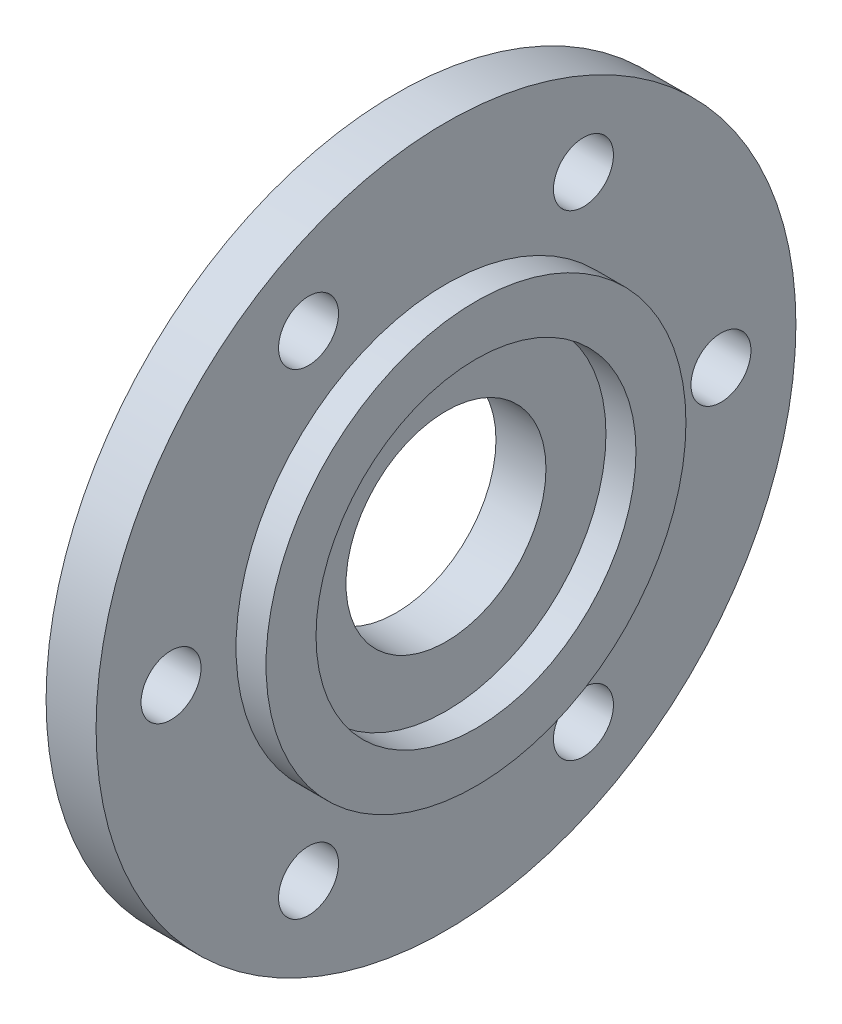
ISO-10303-21;
HEADER;
FILE_DESCRIPTION(('STEP AP214'),'2;1');
FILE_NAME('part.step','',(''),(''),'','','');
FILE_SCHEMA(('AUTOMOTIVE_DESIGN { 1 0 10303 214 1 1 1 1 }'));
ENDSEC;
DATA;
#1=APPLICATION_CONTEXT('core data for automotive mechanical design processes');
#2=APPLICATION_PROTOCOL_DEFINITION('international standard','automotive_design',2000,#1);
#3=PRODUCT_CONTEXT('',#1,'mechanical');
#4=PRODUCT('Part','Part','',(#3));
#5=PRODUCT_RELATED_PRODUCT_CATEGORY('part','',(#4));
#6=PRODUCT_DEFINITION_FORMATION('','',#4);
#7=PRODUCT_DEFINITION_CONTEXT('part definition',#1,'design');
#8=PRODUCT_DEFINITION('design','',#6,#7);
#9=PRODUCT_DEFINITION_SHAPE('','',#8);
#10=(LENGTH_UNIT() NAMED_UNIT(*) SI_UNIT(.MILLI.,.METRE.));
#11=(NAMED_UNIT(*) PLANE_ANGLE_UNIT() SI_UNIT($,.RADIAN.));
#12=(NAMED_UNIT(*) SI_UNIT($,.STERADIAN.) SOLID_ANGLE_UNIT());
#13=UNCERTAINTY_MEASURE_WITH_UNIT(LENGTH_MEASURE(1.E-05),#10,'distance_accuracy_value','');
#14=(GEOMETRIC_REPRESENTATION_CONTEXT(3) GLOBAL_UNCERTAINTY_ASSIGNED_CONTEXT((#13)) GLOBAL_UNIT_ASSIGNED_CONTEXT((#10,
#11,#12)) REPRESENTATION_CONTEXT('',''));
#15=CARTESIAN_POINT('',(0.,0.,0.));
#16=DIRECTION('',(0.,0.,1.));
#17=DIRECTION('',(1.,0.,0.));
#18=AXIS2_PLACEMENT_3D('',#15,#16,#17);
#19=CARTESIAN_POINT('',(0.,0.,0.));
#20=DIRECTION('',(-1.,0.,0.));
#21=DIRECTION('',(0.,0.,1.));
#22=AXIS2_PLACEMENT_3D('',#19,#20,#21);
#23=PLANE('',#22);
#24=CARTESIAN_POINT('',(0.,0.,0.));
#25=DIRECTION('',(-1.,0.,0.));
#26=DIRECTION('',(0.,0.,1.));
#27=AXIS2_PLACEMENT_3D('',#24,#25,#26);
#28=CIRCLE('',#27,10.);
#29=CARTESIAN_POINT('',(0.,0.,10.));
#30=VERTEX_POINT('',#29);
#31=EDGE_CURVE('E39',#30,#30,#28,.T.);
#32=ORIENTED_EDGE('',*,*,#31,.F.);
#33=EDGE_LOOP('',(#32));
#34=FACE_BOUND('',#33,.T.);
#35=CARTESIAN_POINT('',(0.,-23.8156986040719,-13.7500000000003));
#36=DIRECTION('',(-1.,0.,0.));
#37=DIRECTION('',(0.,0.,1.));
#38=AXIS2_PLACEMENT_3D('',#35,#36,#37);
#39=CIRCLE('',#38,3.);
#40=CARTESIAN_POINT('',(0.,-23.8156986040719,-10.7500000000003));
#41=VERTEX_POINT('',#40);
#42=EDGE_CURVE('E75',#41,#41,#39,.T.);
#43=ORIENTED_EDGE('',*,*,#42,.F.);
#44=EDGE_LOOP('',(#43));
#45=FACE_BOUND('',#44,.T.);
#46=CARTESIAN_POINT('',(0.,-23.8156986040722,13.7499999999998));
#47=DIRECTION('',(-1.,0.,0.));
#48=DIRECTION('',(0.,0.,1.));
#49=AXIS2_PLACEMENT_3D('',#46,#47,#48);
#50=CIRCLE('',#49,3.);
#51=CARTESIAN_POINT('',(0.,-23.8156986040722,16.7499999999998));
#52=VERTEX_POINT('',#51);
#53=EDGE_CURVE('E79',#52,#52,#50,.T.);
#54=ORIENTED_EDGE('',*,*,#53,.F.);
#55=EDGE_LOOP('',(#54));
#56=FACE_BOUND('',#55,.T.);
#57=CARTESIAN_POINT('',(0.,0.,27.5));
#58=DIRECTION('',(-1.,0.,0.));
#59=DIRECTION('',(0.,0.,1.));
#60=AXIS2_PLACEMENT_3D('',#57,#58,#59);
#61=CIRCLE('',#60,3.);
#62=CARTESIAN_POINT('',(0.,0.,30.5));
#63=VERTEX_POINT('',#62);
#64=EDGE_CURVE('E83',#63,#63,#61,.T.);
#65=ORIENTED_EDGE('',*,*,#64,.F.);
#66=EDGE_LOOP('',(#65));
#67=FACE_BOUND('',#66,.T.);
#68=CARTESIAN_POINT('',(0.,23.815698604072,13.7500000000001));
#69=DIRECTION('',(-1.,0.,0.));
#70=DIRECTION('',(0.,0.,1.));
#71=AXIS2_PLACEMENT_3D('',#68,#69,#70);
#72=CIRCLE('',#71,3.);
#73=CARTESIAN_POINT('',(0.,23.815698604072,16.7500000000001));
#74=VERTEX_POINT('',#73);
#75=EDGE_CURVE('E87',#74,#74,#72,.T.);
#76=ORIENTED_EDGE('',*,*,#75,.F.);
#77=EDGE_LOOP('',(#76));
#78=FACE_BOUND('',#77,.T.);
#79=CARTESIAN_POINT('',(0.,23.8156986040721,-13.7499999999999));
#80=DIRECTION('',(-1.,0.,0.));
#81=DIRECTION('',(0.,0.,1.));
#82=AXIS2_PLACEMENT_3D('',#79,#80,#81);
#83=CIRCLE('',#82,3.);
#84=CARTESIAN_POINT('',(0.,23.8156986040721,-10.7499999999999));
#85=VERTEX_POINT('',#84);
#86=EDGE_CURVE('E91',#85,#85,#83,.T.);
#87=ORIENTED_EDGE('',*,*,#86,.F.);
#88=EDGE_LOOP('',(#87));
#89=FACE_BOUND('',#88,.T.);
#90=CARTESIAN_POINT('',(0.,0.,-27.5));
#91=DIRECTION('',(-1.,0.,0.));
#92=DIRECTION('',(0.,0.,1.));
#93=AXIS2_PLACEMENT_3D('',#90,#91,#92);
#94=CIRCLE('',#93,3.);
#95=CARTESIAN_POINT('',(0.,0.,-24.5));
#96=VERTEX_POINT('',#95);
#97=EDGE_CURVE('E67',#96,#96,#94,.T.);
#98=ORIENTED_EDGE('',*,*,#97,.F.);
#99=EDGE_LOOP('',(#98));
#100=FACE_BOUND('',#99,.T.);
#101=CARTESIAN_POINT('',(0.,0.,0.));
#102=DIRECTION('',(1.,0.,0.));
#103=DIRECTION('',(0.,0.,-1.));
#104=AXIS2_PLACEMENT_3D('',#101,#102,#103);
#105=CIRCLE('',#104,35.);
#106=CARTESIAN_POINT('',(0.,0.,-35.));
#107=VERTEX_POINT('',#106);
#108=EDGE_CURVE('E10',#107,#107,#105,.T.);
#109=ORIENTED_EDGE('',*,*,#108,.F.);
#110=EDGE_LOOP('',(#109));
#111=FACE_BOUND('',#110,.T.);
#112=ADVANCED_FACE('F36',(#34,#45,#56,#67,#78,#89,#100,#111),#23,.T.);
#113=CARTESIAN_POINT('',(5.,0.,0.));
#114=DIRECTION('',(1.,0.,0.));
#115=DIRECTION('',(0.,0.,-1.));
#116=AXIS2_PLACEMENT_3D('',#113,#114,#115);
#117=CYLINDRICAL_SURFACE('',#116,35.);
#118=ORIENTED_EDGE('',*,*,#108,.T.);
#119=EDGE_LOOP('',(#118));
#120=FACE_BOUND('',#119,.T.);
#121=CARTESIAN_POINT('',(5.,0.,0.));
#122=DIRECTION('',(1.,0.,0.));
#123=DIRECTION('',(0.,0.,-1.));
#124=AXIS2_PLACEMENT_3D('',#121,#122,#123);
#125=CIRCLE('',#124,35.);
#126=CARTESIAN_POINT('',(5.,0.,-35.));
#127=VERTEX_POINT('',#126);
#128=EDGE_CURVE('E44',#127,#127,#125,.T.);
#129=ORIENTED_EDGE('',*,*,#128,.F.);
#130=EDGE_LOOP('',(#129));
#131=FACE_BOUND('',#130,.T.);
#132=ADVANCED_FACE('F128',(#120,#131),#117,.T.);
#133=CARTESIAN_POINT('',(5.,35.,0.));
#134=DIRECTION('',(1.,0.,0.));
#135=DIRECTION('',(0.,0.,-1.));
#136=AXIS2_PLACEMENT_3D('',#133,#134,#135);
#137=PLANE('',#136);
#138=CARTESIAN_POINT('',(5.,-23.8156986040719,-13.7500000000003));
#139=DIRECTION('',(1.,0.,0.));
#140=DIRECTION('',(0.,-0.866025403784433,-0.50000000000001));
#141=AXIS2_PLACEMENT_3D('',#138,#139,#140);
#142=CIRCLE('',#141,3.);
#143=CARTESIAN_POINT('',(5.,-26.4137748154252,-15.2500000000003));
#144=VERTEX_POINT('',#143);
#145=EDGE_CURVE('E100',#144,#144,#142,.T.);
#146=ORIENTED_EDGE('',*,*,#145,.F.);
#147=EDGE_LOOP('',(#146));
#148=FACE_BOUND('',#147,.T.);
#149=CARTESIAN_POINT('',(5.,-23.8156986040722,13.7499999999998));
#150=DIRECTION('',(1.,0.,0.));
#151=DIRECTION('',(0.,-0.866025403784443,0.499999999999992));
#152=AXIS2_PLACEMENT_3D('',#149,#150,#151);
#153=CIRCLE('',#152,3.);
#154=CARTESIAN_POINT('',(5.,-26.4137748154255,15.2499999999998));
#155=VERTEX_POINT('',#154);
#156=EDGE_CURVE('E104',#155,#155,#153,.T.);
#157=ORIENTED_EDGE('',*,*,#156,.F.);
#158=EDGE_LOOP('',(#157));
#159=FACE_BOUND('',#158,.T.);
#160=CARTESIAN_POINT('',(5.,0.,27.5));
#161=DIRECTION('',(1.,0.,0.));
#162=DIRECTION('',(0.,0.,1.));
#163=AXIS2_PLACEMENT_3D('',#160,#161,#162);
#164=CIRCLE('',#163,3.);
#165=CARTESIAN_POINT('',(5.,0.,30.5));
#166=VERTEX_POINT('',#165);
#167=EDGE_CURVE('E108',#166,#166,#164,.T.);
#168=ORIENTED_EDGE('',*,*,#167,.F.);
#169=EDGE_LOOP('',(#168));
#170=FACE_BOUND('',#169,.T.);
#171=CARTESIAN_POINT('',(5.,23.815698604072,13.7500000000001));
#172=DIRECTION('',(1.,0.,0.));
#173=DIRECTION('',(0.,0.866025403784436,0.500000000000004));
#174=AXIS2_PLACEMENT_3D('',#171,#172,#173);
#175=CIRCLE('',#174,3.);
#176=CARTESIAN_POINT('',(5.,26.4137748154253,15.2500000000001));
#177=VERTEX_POINT('',#176);
#178=EDGE_CURVE('E99',#177,#177,#175,.T.);
#179=ORIENTED_EDGE('',*,*,#178,.F.);
#180=EDGE_LOOP('',(#179));
#181=FACE_BOUND('',#180,.T.);
#182=CARTESIAN_POINT('',(5.,23.8156986040721,-13.7499999999999));
#183=DIRECTION('',(1.,0.,0.));
#184=DIRECTION('',(0.,0.86602540378444,-0.499999999999998));
#185=AXIS2_PLACEMENT_3D('',#182,#183,#184);
#186=CIRCLE('',#185,3.);
#187=CARTESIAN_POINT('',(5.,26.4137748154254,-15.2499999999999));
#188=VERTEX_POINT('',#187);
#189=EDGE_CURVE('E95',#188,#188,#186,.T.);
#190=ORIENTED_EDGE('',*,*,#189,.F.);
#191=EDGE_LOOP('',(#190));
#192=FACE_BOUND('',#191,.T.);
#193=CARTESIAN_POINT('',(5.,0.,-27.5));
#194=DIRECTION('',(1.,0.,0.));
#195=DIRECTION('',(0.,0.,-1.));
#196=AXIS2_PLACEMENT_3D('',#193,#194,#195);
#197=CIRCLE('',#196,3.);
#198=CARTESIAN_POINT('',(5.,0.,-30.5));
#199=VERTEX_POINT('',#198);
#200=EDGE_CURVE('E71',#199,#199,#197,.T.);
#201=ORIENTED_EDGE('',*,*,#200,.F.);
#202=EDGE_LOOP('',(#201));
#203=FACE_BOUND('',#202,.T.);
#204=ORIENTED_EDGE('',*,*,#128,.T.);
#205=EDGE_LOOP('',(#204));
#206=FACE_BOUND('',#205,.T.);
#207=CARTESIAN_POINT('',(5.,0.,0.));
#208=DIRECTION('',(1.,0.,0.));
#209=DIRECTION('',(0.,0.,-1.));
#210=AXIS2_PLACEMENT_3D('',#207,#208,#209);
#211=CIRCLE('',#210,21.);
#212=CARTESIAN_POINT('',(5.,0.,-21.));
#213=VERTEX_POINT('',#212);
#214=EDGE_CURVE('E49',#213,#213,#211,.T.);
#215=ORIENTED_EDGE('',*,*,#214,.F.);
#216=EDGE_LOOP('',(#215));
#217=FACE_BOUND('',#216,.T.);
#218=ADVANCED_FACE('F150',(#148,#159,#170,#181,#192,#203,#206,#217),#137,.T.);
#219=CARTESIAN_POINT('',(5.,0.,0.));
#220=DIRECTION('',(1.,0.,0.));
#221=DIRECTION('',(0.,0.,-1.));
#222=AXIS2_PLACEMENT_3D('',#219,#220,#221);
#223=CYLINDRICAL_SURFACE('',#222,21.);
#224=ORIENTED_EDGE('',*,*,#214,.T.);
#225=EDGE_LOOP('',(#224));
#226=FACE_BOUND('',#225,.T.);
#227=CARTESIAN_POINT('',(8.,0.,0.));
#228=DIRECTION('',(1.,0.,0.));
#229=DIRECTION('',(0.,0.,-1.));
#230=AXIS2_PLACEMENT_3D('',#227,#228,#229);
#231=CIRCLE('',#230,21.);
#232=CARTESIAN_POINT('',(8.,0.,-21.));
#233=VERTEX_POINT('',#232);
#234=EDGE_CURVE('E55',#233,#233,#231,.T.);
#235=ORIENTED_EDGE('',*,*,#234,.F.);
#236=EDGE_LOOP('',(#235));
#237=FACE_BOUND('',#236,.T.);
#238=ADVANCED_FACE('F153',(#226,#237),#223,.T.);
#239=CARTESIAN_POINT('',(8.,21.,0.));
#240=DIRECTION('',(1.,0.,0.));
#241=DIRECTION('',(0.,0.,-1.));
#242=AXIS2_PLACEMENT_3D('',#239,#240,#241);
#243=PLANE('',#242);
#244=ORIENTED_EDGE('',*,*,#234,.T.);
#245=EDGE_LOOP('',(#244));
#246=FACE_BOUND('',#245,.T.);
#247=CARTESIAN_POINT('',(8.,0.,0.));
#248=DIRECTION('',(1.,0.,0.));
#249=DIRECTION('',(0.,0.,-1.));
#250=AXIS2_PLACEMENT_3D('',#247,#248,#249);
#251=CIRCLE('',#250,16.);
#252=CARTESIAN_POINT('',(8.,0.,-16.));
#253=VERTEX_POINT('',#252);
#254=EDGE_CURVE('E59',#253,#253,#251,.T.);
#255=ORIENTED_EDGE('',*,*,#254,.F.);
#256=EDGE_LOOP('',(#255));
#257=FACE_BOUND('',#256,.T.);
#258=ADVANCED_FACE('F162',(#246,#257),#243,.T.);
#259=CARTESIAN_POINT('',(5.,0.,0.));
#260=DIRECTION('',(1.,0.,0.));
#261=DIRECTION('',(0.,0.,-1.));
#262=AXIS2_PLACEMENT_3D('',#259,#260,#261);
#263=CYLINDRICAL_SURFACE('',#262,16.);
#264=ORIENTED_EDGE('',*,*,#254,.T.);
#265=EDGE_LOOP('',(#264));
#266=FACE_BOUND('',#265,.T.);
#267=CARTESIAN_POINT('',(5.,0.,0.));
#268=DIRECTION('',(1.,0.,0.));
#269=DIRECTION('',(0.,0.,-1.));
#270=AXIS2_PLACEMENT_3D('',#267,#268,#269);
#271=CIRCLE('',#270,16.);
#272=CARTESIAN_POINT('',(5.,0.,-16.));
#273=VERTEX_POINT('',#272);
#274=EDGE_CURVE('E63',#273,#273,#271,.T.);
#275=ORIENTED_EDGE('',*,*,#274,.F.);
#276=EDGE_LOOP('',(#275));
#277=FACE_BOUND('',#276,.T.);
#278=ADVANCED_FACE('F168',(#266,#277),#263,.F.);
#279=CARTESIAN_POINT('',(5.,16.,0.));
#280=DIRECTION('',(1.,0.,0.));
#281=DIRECTION('',(0.,0.,-1.));
#282=AXIS2_PLACEMENT_3D('',#279,#280,#281);
#283=PLANE('',#282);
#284=CARTESIAN_POINT('',(5.,0.,0.));
#285=DIRECTION('',(1.,0.,0.));
#286=DIRECTION('',(0.,0.,-1.));
#287=AXIS2_PLACEMENT_3D('',#284,#285,#286);
#288=CIRCLE('',#287,10.);
#289=CARTESIAN_POINT('',(5.,0.,-10.));
#290=VERTEX_POINT('',#289);
#291=EDGE_CURVE('E115',#290,#290,#288,.T.);
#292=ORIENTED_EDGE('',*,*,#291,.F.);
#293=EDGE_LOOP('',(#292));
#294=FACE_BOUND('',#293,.T.);
#295=ORIENTED_EDGE('',*,*,#274,.T.);
#296=EDGE_LOOP('',(#295));
#297=FACE_BOUND('',#296,.T.);
#298=ADVANCED_FACE('F146',(#294,#297),#283,.T.);
#299=CARTESIAN_POINT('',(-5.,0.,-27.5));
#300=DIRECTION('',(1.,0.,0.));
#301=DIRECTION('',(0.,0.,-1.));
#302=AXIS2_PLACEMENT_3D('',#299,#300,#301);
#303=CYLINDRICAL_SURFACE('',#302,3.);
#304=ORIENTED_EDGE('',*,*,#97,.T.);
#305=EDGE_LOOP('',(#304));
#306=FACE_BOUND('',#305,.T.);
#307=ORIENTED_EDGE('',*,*,#200,.T.);
#308=EDGE_LOOP('',(#307));
#309=FACE_BOUND('',#308,.T.);
#310=ADVANCED_FACE('F142',(#306,#309),#303,.F.);
#311=CARTESIAN_POINT('',(-5.,23.8156986040721,-13.7499999999999));
#312=DIRECTION('',(1.,0.,0.));
#313=DIRECTION('',(0.,0.,-1.));
#314=AXIS2_PLACEMENT_3D('',#311,#312,#313);
#315=CYLINDRICAL_SURFACE('',#314,3.);
#316=ORIENTED_EDGE('',*,*,#86,.T.);
#317=EDGE_LOOP('',(#316));
#318=FACE_BOUND('',#317,.T.);
#319=ORIENTED_EDGE('',*,*,#189,.T.);
#320=EDGE_LOOP('',(#319));
#321=FACE_BOUND('',#320,.T.);
#322=ADVANCED_FACE('F145',(#318,#321),#315,.F.);
#323=CARTESIAN_POINT('',(-5.,23.815698604072,13.7500000000001));
#324=DIRECTION('',(1.,0.,0.));
#325=DIRECTION('',(0.,0.,-1.));
#326=AXIS2_PLACEMENT_3D('',#323,#324,#325);
#327=CYLINDRICAL_SURFACE('',#326,3.);
#328=ORIENTED_EDGE('',*,*,#75,.T.);
#329=EDGE_LOOP('',(#328));
#330=FACE_BOUND('',#329,.T.);
#331=ORIENTED_EDGE('',*,*,#178,.T.);
#332=EDGE_LOOP('',(#331));
#333=FACE_BOUND('',#332,.T.);
#334=ADVANCED_FACE('F221',(#330,#333),#327,.F.);
#335=CARTESIAN_POINT('',(-5.,0.,27.5));
#336=DIRECTION('',(1.,0.,0.));
#337=DIRECTION('',(0.,0.,-1.));
#338=AXIS2_PLACEMENT_3D('',#335,#336,#337);
#339=CYLINDRICAL_SURFACE('',#338,3.);
#340=ORIENTED_EDGE('',*,*,#64,.T.);
#341=EDGE_LOOP('',(#340));
#342=FACE_BOUND('',#341,.T.);
#343=ORIENTED_EDGE('',*,*,#167,.T.);
#344=EDGE_LOOP('',(#343));
#345=FACE_BOUND('',#344,.T.);
#346=ADVANCED_FACE('F228',(#342,#345),#339,.F.);
#347=CARTESIAN_POINT('',(-5.,-23.8156986040722,13.7499999999998));
#348=DIRECTION('',(1.,0.,0.));
#349=DIRECTION('',(0.,0.,-1.));
#350=AXIS2_PLACEMENT_3D('',#347,#348,#349);
#351=CYLINDRICAL_SURFACE('',#350,3.);
#352=ORIENTED_EDGE('',*,*,#53,.T.);
#353=EDGE_LOOP('',(#352));
#354=FACE_BOUND('',#353,.T.);
#355=ORIENTED_EDGE('',*,*,#156,.T.);
#356=EDGE_LOOP('',(#355));
#357=FACE_BOUND('',#356,.T.);
#358=ADVANCED_FACE('F236',(#354,#357),#351,.F.);
#359=CARTESIAN_POINT('',(-5.,-23.8156986040719,-13.7500000000003));
#360=DIRECTION('',(1.,0.,0.));
#361=DIRECTION('',(0.,0.,-1.));
#362=AXIS2_PLACEMENT_3D('',#359,#360,#361);
#363=CYLINDRICAL_SURFACE('',#362,3.);
#364=ORIENTED_EDGE('',*,*,#42,.T.);
#365=EDGE_LOOP('',(#364));
#366=FACE_BOUND('',#365,.T.);
#367=ORIENTED_EDGE('',*,*,#145,.T.);
#368=EDGE_LOOP('',(#367));
#369=FACE_BOUND('',#368,.T.);
#370=ADVANCED_FACE('F244',(#366,#369),#363,.F.);
#371=CARTESIAN_POINT('',(-5.,0.,0.));
#372=DIRECTION('',(1.,0.,0.));
#373=DIRECTION('',(0.,0.,-1.));
#374=AXIS2_PLACEMENT_3D('',#371,#372,#373);
#375=CYLINDRICAL_SURFACE('',#374,10.);
#376=ORIENTED_EDGE('',*,*,#31,.T.);
#377=EDGE_LOOP('',(#376));
#378=FACE_BOUND('',#377,.T.);
#379=ORIENTED_EDGE('',*,*,#291,.T.);
#380=EDGE_LOOP('',(#379));
#381=FACE_BOUND('',#380,.T.);
#382=ADVANCED_FACE('F124',(#378,#381),#375,.F.);
#383=CLOSED_SHELL('',(#112,#132,#218,#238,#258,#278,#298,#310,#322,#334,#346,#358,#370,#382));
#384=MANIFOLD_SOLID_BREP('B2',#383);
#385=ADVANCED_BREP_SHAPE_REPRESENTATION('',(#18,#384),#14);
#386=SHAPE_DEFINITION_REPRESENTATION(#9,#385);
ENDSEC;
END-ISO-10303-21;
